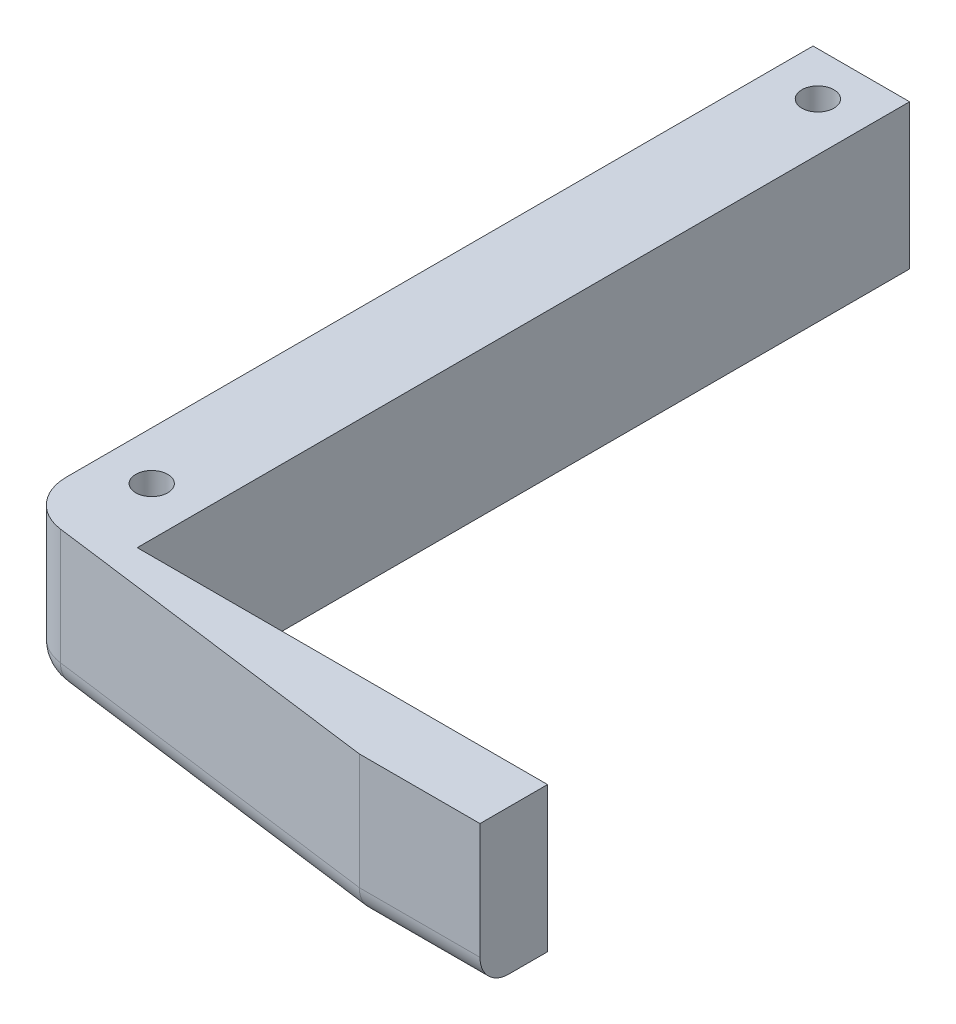
ISO-10303-21;
HEADER;
FILE_DESCRIPTION(('STEP AP214'),'2;1');
FILE_NAME('part.step','',(''),(''),'','','');
FILE_SCHEMA(('AUTOMOTIVE_DESIGN { 1 0 10303 214 1 1 1 1 }'));
ENDSEC;
DATA;
#1=APPLICATION_CONTEXT('core data for automotive mechanical design processes');
#2=APPLICATION_PROTOCOL_DEFINITION('international standard','automotive_design',2000,#1);
#3=PRODUCT_CONTEXT('',#1,'mechanical');
#4=PRODUCT('Part','Part','',(#3));
#5=PRODUCT_RELATED_PRODUCT_CATEGORY('part','',(#4));
#6=PRODUCT_DEFINITION_FORMATION('','',#4);
#7=PRODUCT_DEFINITION_CONTEXT('part definition',#1,'design');
#8=PRODUCT_DEFINITION('design','',#6,#7);
#9=PRODUCT_DEFINITION_SHAPE('','',#8);
#10=(LENGTH_UNIT() NAMED_UNIT(*) SI_UNIT(.MILLI.,.METRE.));
#11=(NAMED_UNIT(*) PLANE_ANGLE_UNIT() SI_UNIT($,.RADIAN.));
#12=(NAMED_UNIT(*) SI_UNIT($,.STERADIAN.) SOLID_ANGLE_UNIT());
#13=UNCERTAINTY_MEASURE_WITH_UNIT(LENGTH_MEASURE(1.E-05),#10,'distance_accuracy_value','');
#14=(GEOMETRIC_REPRESENTATION_CONTEXT(3) GLOBAL_UNCERTAINTY_ASSIGNED_CONTEXT((#13)) GLOBAL_UNIT_ASSIGNED_CONTEXT((#10,
#11,#12)) REPRESENTATION_CONTEXT('',''));
#15=CARTESIAN_POINT('',(0.,0.,0.));
#16=DIRECTION('',(0.,0.,1.));
#17=DIRECTION('',(1.,0.,0.));
#18=AXIS2_PLACEMENT_3D('',#15,#16,#17);
#19=CARTESIAN_POINT('',(0.,15.,0.));
#20=DIRECTION('',(0.,1.,0.));
#21=DIRECTION('',(0.,0.,-1.));
#22=AXIS2_PLACEMENT_3D('',#19,#20,#21);
#23=PLANE('',#22);
#24=CARTESIAN_POINT('',(-35.2774040599402,15.,-24.4533066809845));
#25=DIRECTION('',(0.,-1.,0.));
#26=DIRECTION('',(0.,0.,-1.));
#27=AXIS2_PLACEMENT_3D('',#24,#25,#26);
#28=CIRCLE('',#27,1.66);
#29=CARTESIAN_POINT('',(-35.2774040599402,15.,-26.1133066809845));
#30=VERTEX_POINT('',#29);
#31=EDGE_CURVE('E162',#30,#30,#28,.T.);
#32=ORIENTED_EDGE('',*,*,#31,.T.);
#33=EDGE_LOOP('',(#32));
#34=FACE_BOUND('',#33,.T.);
#35=DIRECTION('',(0.991444861373811,0.,0.130526192220048));
#36=VECTOR('',#35,1.);
#37=CARTESIAN_POINT('',(-7.51652102515629,15.,57.0936454902174));
#38=LINE('',#37,#36);
#39=CARTESIAN_POINT('',(-0.277404059939151,15.,58.0466933190155));
#40=VERTEX_POINT('',#39);
#41=CARTESIAN_POINT('',(-35.9300350210405,15.,53.3529354074249));
#42=VERTEX_POINT('',#41);
#43=EDGE_CURVE('E179',#40,#42,#38,.F.);
#44=ORIENTED_EDGE('',*,*,#43,.F.);
#45=DIRECTION('',(-1.,0.,0.));
#46=VECTOR('',#45,1.);
#47=CARTESIAN_POINT('',(12.2225959400598,15.,58.0466933190155));
#48=LINE('',#47,#46);
#49=CARTESIAN_POINT('',(12.2225959400598,15.,58.0466933190155));
#50=VERTEX_POINT('',#49);
#51=EDGE_CURVE('E140',#50,#40,#48,.T.);
#52=ORIENTED_EDGE('',*,*,#51,.F.);
#53=DIRECTION('',(0.,0.,1.));
#54=VECTOR('',#53,1.);
#55=CARTESIAN_POINT('',(12.2225959400597,15.,51.0466933190155));
#56=LINE('',#55,#54);
#57=CARTESIAN_POINT('',(12.2225959400597,15.,51.0466933190155));
#58=VERTEX_POINT('',#57);
#59=EDGE_CURVE('E154',#58,#50,#56,.T.);
#60=ORIENTED_EDGE('',*,*,#59,.F.);
#61=DIRECTION('',(1.,0.,0.));
#62=VECTOR('',#61,1.);
#63=CARTESIAN_POINT('',(-30.2774040599402,15.,51.0466933190155));
#64=LINE('',#63,#62);
#65=CARTESIAN_POINT('',(-30.2774040599402,15.,51.0466933190155));
#66=VERTEX_POINT('',#65);
#67=EDGE_CURVE('E148',#66,#58,#64,.T.);
#68=ORIENTED_EDGE('',*,*,#67,.F.);
#69=DIRECTION('',(0.,0.,1.));
#70=VECTOR('',#69,1.);
#71=CARTESIAN_POINT('',(-30.2774040599402,15.,-28.9533066809845));
#72=LINE('',#71,#70);
#73=CARTESIAN_POINT('',(-30.2774040599402,15.,-28.9533066809845));
#74=VERTEX_POINT('',#73);
#75=EDGE_CURVE('E146',#74,#66,#72,.T.);
#76=ORIENTED_EDGE('',*,*,#75,.F.);
#77=DIRECTION('',(1.,0.,0.));
#78=VECTOR('',#77,1.);
#79=CARTESIAN_POINT('',(-40.2774040599402,15.,-28.9533066809845));
#80=LINE('',#79,#78);
#81=CARTESIAN_POINT('',(-40.2774040599402,15.,-28.9533066809845));
#82=VERTEX_POINT('',#81);
#83=EDGE_CURVE('E122',#82,#74,#80,.T.);
#84=ORIENTED_EDGE('',*,*,#83,.F.);
#85=DIRECTION('',(0.,0.,-1.));
#86=VECTOR('',#85,1.);
#87=CARTESIAN_POINT('',(-40.2774040599402,15.,58.0466933190154));
#88=LINE('',#87,#86);
#89=CARTESIAN_POINT('',(-40.2774040599402,15.,48.3957111005558));
#90=VERTEX_POINT('',#89);
#91=EDGE_CURVE('E133',#90,#82,#88,.T.);
#92=ORIENTED_EDGE('',*,*,#91,.F.);
#93=CARTESIAN_POINT('',(-35.2774040599402,15.,48.3957111005558));
#94=DIRECTION('',(0.,-1.,0.));
#95=DIRECTION('',(0.,0.,-1.));
#96=AXIS2_PLACEMENT_3D('',#93,#94,#95);
#97=CIRCLE('',#96,5.);
#98=EDGE_CURVE('E185',#42,#90,#97,.T.);
#99=ORIENTED_EDGE('',*,*,#98,.F.);
#100=EDGE_LOOP('',(#44,#52,#60,#68,#76,#84,#92,#99));
#101=FACE_BOUND('',#100,.T.);
#102=CARTESIAN_POINT('',(-35.2774040599403,15.,44.5466933190155));
#103=DIRECTION('',(0.,-1.,0.));
#104=DIRECTION('',(0.,0.,-1.));
#105=AXIS2_PLACEMENT_3D('',#102,#103,#104);
#106=CIRCLE('',#105,1.66);
#107=CARTESIAN_POINT('',(-35.2774040599403,15.,42.8866933190155));
#108=VERTEX_POINT('',#107);
#109=EDGE_CURVE('E211',#108,#108,#106,.T.);
#110=ORIENTED_EDGE('',*,*,#109,.T.);
#111=EDGE_LOOP('',(#110));
#112=FACE_BOUND('',#111,.T.);
#113=ADVANCED_FACE('F37',(#34,#101,#112),#23,.T.);
#114=CARTESIAN_POINT('',(0.,0.,0.));
#115=DIRECTION('',(0.,1.,0.));
#116=DIRECTION('',(0.,0.,-1.));
#117=AXIS2_PLACEMENT_3D('',#114,#115,#116);
#118=PLANE('',#117);
#119=DIRECTION('',(1.,0.,0.));
#120=VECTOR('',#119,1.);
#121=CARTESIAN_POINT('',(-40.2774040599402,0.,-28.9533066809845));
#122=LINE('',#121,#120);
#123=CARTESIAN_POINT('',(-37.2774040599402,0.,-28.9533066809845));
#124=VERTEX_POINT('',#123);
#125=CARTESIAN_POINT('',(-30.2774040599402,0.,-28.9533066809845));
#126=VERTEX_POINT('',#125);
#127=EDGE_CURVE('E158',#124,#126,#122,.T.);
#128=ORIENTED_EDGE('',*,*,#127,.T.);
#129=DIRECTION('',(0.,0.,1.));
#130=VECTOR('',#129,1.);
#131=CARTESIAN_POINT('',(-30.2774040599402,0.,-28.9533066809845));
#132=LINE('',#131,#130);
#133=CARTESIAN_POINT('',(-30.2774040599402,0.,51.0466933190155));
#134=VERTEX_POINT('',#133);
#135=EDGE_CURVE('E161',#126,#134,#132,.T.);
#136=ORIENTED_EDGE('',*,*,#135,.T.);
#137=DIRECTION('',(1.,0.,0.));
#138=VECTOR('',#137,1.);
#139=CARTESIAN_POINT('',(-30.2774040599402,0.,51.0466933190155));
#140=LINE('',#139,#138);
#141=CARTESIAN_POINT('',(12.2225959400597,0.,51.0466933190155));
#142=VERTEX_POINT('',#141);
#143=EDGE_CURVE('E165',#134,#142,#140,.T.);
#144=ORIENTED_EDGE('',*,*,#143,.T.);
#145=DIRECTION('',(0.,0.,1.));
#146=VECTOR('',#145,1.);
#147=CARTESIAN_POINT('',(12.2225959400597,0.,51.0466933190155));
#148=LINE('',#147,#146);
#149=CARTESIAN_POINT('',(12.2225959400597,0.,55.0466933190155));
#150=VERTEX_POINT('',#149);
#151=EDGE_CURVE('E168',#142,#150,#148,.T.);
#152=ORIENTED_EDGE('',*,*,#151,.T.);
#153=DIRECTION('',(-1.,0.,0.));
#154=VECTOR('',#153,1.);
#155=CARTESIAN_POINT('',(0.,0.,55.0466933190155));
#156=LINE('',#155,#154);
#157=CARTESIAN_POINT('',(-0.0807736714934411,0.,55.0466933190155));
#158=VERTEX_POINT('',#157);
#159=EDGE_CURVE('E187',#158,#150,#156,.F.);
#160=ORIENTED_EDGE('',*,*,#159,.F.);
#161=DIRECTION('',(-0.991444861373811,0.,-0.130526192220048));
#162=VECTOR('',#161,1.);
#163=CARTESIAN_POINT('',(0.114174516720995,0.,55.072358734894));
#164=LINE('',#163,#162);
#165=CARTESIAN_POINT('',(-35.5384564443803,0.,50.3786008233034));
#166=VERTEX_POINT('',#165);
#167=EDGE_CURVE('E189',#166,#158,#164,.F.);
#168=ORIENTED_EDGE('',*,*,#167,.F.);
#169=CARTESIAN_POINT('',(-35.2774040599402,0.,48.3957111005558));
#170=DIRECTION('',(0.,-1.,0.));
#171=DIRECTION('',(0.,0.,-1.));
#172=AXIS2_PLACEMENT_3D('',#169,#170,#171);
#173=CIRCLE('',#172,2.);
#174=CARTESIAN_POINT('',(-37.2774040599402,0.,48.3957111005558));
#175=VERTEX_POINT('',#174);
#176=EDGE_CURVE('E191',#175,#166,#173,.F.);
#177=ORIENTED_EDGE('',*,*,#176,.F.);
#178=DIRECTION('',(0.,0.,-1.));
#179=VECTOR('',#178,1.);
#180=CARTESIAN_POINT('',(-37.2774040599402,0.,0.));
#181=LINE('',#180,#179);
#182=EDGE_CURVE('E194',#124,#175,#181,.F.);
#183=ORIENTED_EDGE('',*,*,#182,.F.);
#184=EDGE_LOOP('',(#128,#136,#144,#152,#160,#168,#177,#183));
#185=FACE_BOUND('',#184,.T.);
#186=CARTESIAN_POINT('',(-35.2774040599402,0.,-24.4533066809845));
#187=DIRECTION('',(0.,-1.,0.));
#188=DIRECTION('',(0.,0.,-1.));
#189=AXIS2_PLACEMENT_3D('',#186,#187,#188);
#190=CIRCLE('',#189,1.66);
#191=CARTESIAN_POINT('',(-35.2774040599402,0.,-26.1133066809845));
#192=VERTEX_POINT('',#191);
#193=EDGE_CURVE('E216',#192,#192,#190,.T.);
#194=ORIENTED_EDGE('',*,*,#193,.F.);
#195=EDGE_LOOP('',(#194));
#196=FACE_BOUND('',#195,.T.);
#197=CARTESIAN_POINT('',(-35.2774040599403,0.,44.5466933190155));
#198=DIRECTION('',(0.,-1.,0.));
#199=DIRECTION('',(0.,0.,-1.));
#200=AXIS2_PLACEMENT_3D('',#197,#198,#199);
#201=CIRCLE('',#200,1.66);
#202=CARTESIAN_POINT('',(-35.2774040599403,0.,42.8866933190155));
#203=VERTEX_POINT('',#202);
#204=EDGE_CURVE('E209',#203,#203,#201,.T.);
#205=ORIENTED_EDGE('',*,*,#204,.F.);
#206=EDGE_LOOP('',(#205));
#207=FACE_BOUND('',#206,.T.);
#208=ADVANCED_FACE('F242',(#185,#196,#207),#118,.F.);
#209=CARTESIAN_POINT('',(12.2225959400598,15.,58.0466933190155));
#210=DIRECTION('',(0.,0.,-1.));
#211=DIRECTION('',(1.,0.,0.));
#212=AXIS2_PLACEMENT_3D('',#209,#210,#211);
#213=PLANE('',#212);
#214=DIRECTION('',(0.,-1.,0.));
#215=VECTOR('',#214,1.);
#216=CARTESIAN_POINT('',(12.2225959400598,15.,58.0466933190155));
#217=LINE('',#216,#215);
#218=CARTESIAN_POINT('',(12.2225959400598,3.,58.0466933190155));
#219=VERTEX_POINT('',#218);
#220=EDGE_CURVE('E157',#50,#219,#217,.T.);
#221=ORIENTED_EDGE('',*,*,#220,.F.);
#222=ORIENTED_EDGE('',*,*,#51,.T.);
#223=DIRECTION('',(0.,1.,0.));
#224=VECTOR('',#223,1.);
#225=CARTESIAN_POINT('',(-0.277404059939151,15.,58.0466933190155));
#226=LINE('',#225,#224);
#227=CARTESIAN_POINT('',(-0.277404059939151,3.,58.0466933190155));
#228=VERTEX_POINT('',#227);
#229=EDGE_CURVE('E129',#228,#40,#226,.T.);
#230=ORIENTED_EDGE('',*,*,#229,.F.);
#231=DIRECTION('',(-1.,0.,0.));
#232=VECTOR('',#231,1.);
#233=CARTESIAN_POINT('',(12.2225959400598,3.,58.0466933190155));
#234=LINE('',#233,#232);
#235=EDGE_CURVE('E46',#219,#228,#234,.T.);
#236=ORIENTED_EDGE('',*,*,#235,.F.);
#237=EDGE_LOOP('',(#221,#222,#230,#236));
#238=FACE_BOUND('',#237,.T.);
#239=ADVANCED_FACE('F226',(#238),#213,.F.);
#240=CARTESIAN_POINT('',(-40.2774040599402,15.,58.0466933190154));
#241=DIRECTION('',(1.,0.,0.));
#242=DIRECTION('',(0.,0.,1.));
#243=AXIS2_PLACEMENT_3D('',#240,#241,#242);
#244=PLANE('',#243);
#245=DIRECTION('',(0.,1.,0.));
#246=VECTOR('',#245,1.);
#247=CARTESIAN_POINT('',(-40.2774040599402,0.,48.3957111005558));
#248=LINE('',#247,#246);
#249=CARTESIAN_POINT('',(-40.2774040599402,3.,48.3957111005558));
#250=VERTEX_POINT('',#249);
#251=EDGE_CURVE('E136',#90,#250,#248,.F.);
#252=ORIENTED_EDGE('',*,*,#251,.F.);
#253=ORIENTED_EDGE('',*,*,#91,.T.);
#254=DIRECTION('',(0.,-1.,0.));
#255=VECTOR('',#254,1.);
#256=CARTESIAN_POINT('',(-40.2774040599402,15.,-28.9533066809845));
#257=LINE('',#256,#255);
#258=CARTESIAN_POINT('',(-40.2774040599402,3.,-28.9533066809845));
#259=VERTEX_POINT('',#258);
#260=EDGE_CURVE('E118',#82,#259,#257,.T.);
#261=ORIENTED_EDGE('',*,*,#260,.T.);
#262=DIRECTION('',(0.,0.,-1.));
#263=VECTOR('',#262,1.);
#264=CARTESIAN_POINT('',(-40.2774040599402,3.,58.0466933190154));
#265=LINE('',#264,#263);
#266=EDGE_CURVE('E200',#250,#259,#265,.T.);
#267=ORIENTED_EDGE('',*,*,#266,.F.);
#268=EDGE_LOOP('',(#252,#253,#261,#267));
#269=FACE_BOUND('',#268,.T.);
#270=ADVANCED_FACE('F134',(#269),#244,.F.);
#271=CARTESIAN_POINT('',(-40.2774040599402,15.,-28.9533066809845));
#272=DIRECTION('',(0.,0.,1.));
#273=DIRECTION('',(-1.,0.,0.));
#274=AXIS2_PLACEMENT_3D('',#271,#272,#273);
#275=PLANE('',#274);
#276=ORIENTED_EDGE('',*,*,#260,.F.);
#277=ORIENTED_EDGE('',*,*,#83,.T.);
#278=DIRECTION('',(0.,-1.,0.));
#279=VECTOR('',#278,1.);
#280=CARTESIAN_POINT('',(-30.2774040599402,15.,-28.9533066809845));
#281=LINE('',#280,#279);
#282=EDGE_CURVE('E130',#74,#126,#281,.T.);
#283=ORIENTED_EDGE('',*,*,#282,.T.);
#284=ORIENTED_EDGE('',*,*,#127,.F.);
#285=CARTESIAN_POINT('',(-37.2774040599402,3.,-28.9533066809845));
#286=DIRECTION('',(0.,0.,-1.));
#287=DIRECTION('',(-1.,0.,0.));
#288=AXIS2_PLACEMENT_3D('',#285,#286,#287);
#289=CIRCLE('',#288,3.);
#290=EDGE_CURVE('E125',#259,#124,#289,.F.);
#291=ORIENTED_EDGE('',*,*,#290,.F.);
#292=EDGE_LOOP('',(#276,#277,#283,#284,#291));
#293=FACE_BOUND('',#292,.T.);
#294=ADVANCED_FACE('F120',(#293),#275,.F.);
#295=CARTESIAN_POINT('',(-30.2774040599402,15.,-28.9533066809845));
#296=DIRECTION('',(-1.,0.,0.));
#297=DIRECTION('',(0.,0.,-1.));
#298=AXIS2_PLACEMENT_3D('',#295,#296,#297);
#299=PLANE('',#298);
#300=ORIENTED_EDGE('',*,*,#135,.F.);
#301=ORIENTED_EDGE('',*,*,#282,.F.);
#302=ORIENTED_EDGE('',*,*,#75,.T.);
#303=DIRECTION('',(0.,-1.,0.));
#304=VECTOR('',#303,1.);
#305=CARTESIAN_POINT('',(-30.2774040599402,15.,51.0466933190155));
#306=LINE('',#305,#304);
#307=EDGE_CURVE('E175',#66,#134,#306,.T.);
#308=ORIENTED_EDGE('',*,*,#307,.T.);
#309=EDGE_LOOP('',(#300,#301,#302,#308));
#310=FACE_BOUND('',#309,.T.);
#311=ADVANCED_FACE('F239',(#310),#299,.F.);
#312=CARTESIAN_POINT('',(-30.2774040599402,15.,51.0466933190155));
#313=DIRECTION('',(0.,0.,1.));
#314=DIRECTION('',(-1.,0.,0.));
#315=AXIS2_PLACEMENT_3D('',#312,#313,#314);
#316=PLANE('',#315);
#317=ORIENTED_EDGE('',*,*,#143,.F.);
#318=ORIENTED_EDGE('',*,*,#307,.F.);
#319=ORIENTED_EDGE('',*,*,#67,.T.);
#320=DIRECTION('',(0.,-1.,0.));
#321=VECTOR('',#320,1.);
#322=CARTESIAN_POINT('',(12.2225959400597,15.,51.0466933190155));
#323=LINE('',#322,#321);
#324=EDGE_CURVE('E173',#58,#142,#323,.T.);
#325=ORIENTED_EDGE('',*,*,#324,.T.);
#326=EDGE_LOOP('',(#317,#318,#319,#325));
#327=FACE_BOUND('',#326,.T.);
#328=ADVANCED_FACE('F236',(#327),#316,.F.);
#329=CARTESIAN_POINT('',(12.2225959400597,15.,51.0466933190155));
#330=DIRECTION('',(-1.,0.,0.));
#331=DIRECTION('',(0.,0.,-1.));
#332=AXIS2_PLACEMENT_3D('',#329,#330,#331);
#333=PLANE('',#332);
#334=ORIENTED_EDGE('',*,*,#151,.F.);
#335=ORIENTED_EDGE('',*,*,#324,.F.);
#336=ORIENTED_EDGE('',*,*,#59,.T.);
#337=ORIENTED_EDGE('',*,*,#220,.T.);
#338=CARTESIAN_POINT('',(12.2225959400597,3.,55.0466933190155));
#339=DIRECTION('',(1.,0.,0.));
#340=DIRECTION('',(0.,0.,-1.));
#341=AXIS2_PLACEMENT_3D('',#338,#339,#340);
#342=CIRCLE('',#341,3.);
#343=EDGE_CURVE('E11',#150,#219,#342,.F.);
#344=ORIENTED_EDGE('',*,*,#343,.F.);
#345=EDGE_LOOP('',(#334,#335,#336,#337,#344));
#346=FACE_BOUND('',#345,.T.);
#347=ADVANCED_FACE('F233',(#346),#333,.F.);
#348=CARTESIAN_POINT('',(-35.2774040599402,15.,-24.4533066809845));
#349=DIRECTION('',(0.,-1.,0.));
#350=DIRECTION('',(0.,0.,1.));
#351=AXIS2_PLACEMENT_3D('',#348,#349,#350);
#352=CYLINDRICAL_SURFACE('',#351,1.66);
#353=ORIENTED_EDGE('',*,*,#31,.F.);
#354=EDGE_LOOP('',(#353));
#355=FACE_BOUND('',#354,.T.);
#356=ORIENTED_EDGE('',*,*,#193,.T.);
#357=EDGE_LOOP('',(#356));
#358=FACE_BOUND('',#357,.T.);
#359=ADVANCED_FACE('F269',(#355,#358),#352,.F.);
#360=CARTESIAN_POINT('',(-35.2774040599403,15.,44.5466933190155));
#361=DIRECTION('',(0.,-1.,0.));
#362=DIRECTION('',(0.,0.,1.));
#363=AXIS2_PLACEMENT_3D('',#360,#361,#362);
#364=CYLINDRICAL_SURFACE('',#363,1.66);
#365=ORIENTED_EDGE('',*,*,#109,.F.);
#366=EDGE_LOOP('',(#365));
#367=FACE_BOUND('',#366,.T.);
#368=ORIENTED_EDGE('',*,*,#204,.T.);
#369=EDGE_LOOP('',(#368));
#370=FACE_BOUND('',#369,.T.);
#371=ADVANCED_FACE('F286',(#367,#370),#364,.F.);
#372=CARTESIAN_POINT('',(-40.2774040599402,15.,52.7805934155196));
#373=DIRECTION('',(0.130526192220048,0.,-0.991444861373811));
#374=DIRECTION('',(0.,-1.,0.));
#375=AXIS2_PLACEMENT_3D('',#372,#373,#374);
#376=PLANE('',#375);
#377=ORIENTED_EDGE('',*,*,#229,.T.);
#378=ORIENTED_EDGE('',*,*,#43,.T.);
#379=DIRECTION('',(0.,-1.,0.));
#380=VECTOR('',#379,1.);
#381=CARTESIAN_POINT('',(-35.9300350210405,15.,53.3529354074249));
#382=LINE('',#381,#380);
#383=CARTESIAN_POINT('',(-35.9300350210405,3.,53.3529354074249));
#384=VERTEX_POINT('',#383);
#385=EDGE_CURVE('E183',#384,#42,#382,.F.);
#386=ORIENTED_EDGE('',*,*,#385,.F.);
#387=DIRECTION('',(0.991444861373811,0.,0.130526192220048));
#388=VECTOR('',#387,1.);
#389=CARTESIAN_POINT('',(-35.9300350210405,3.,53.3529354074249));
#390=LINE('',#389,#388);
#391=EDGE_CURVE('E203',#228,#384,#390,.F.);
#392=ORIENTED_EDGE('',*,*,#391,.F.);
#393=EDGE_LOOP('',(#377,#378,#386,#392));
#394=FACE_BOUND('',#393,.T.);
#395=ADVANCED_FACE('F230',(#394),#376,.F.);
#396=CARTESIAN_POINT('',(-35.2774040599402,15.,48.3957111005558));
#397=DIRECTION('',(0.,-1.,0.));
#398=DIRECTION('',(0.,0.,1.));
#399=AXIS2_PLACEMENT_3D('',#396,#397,#398);
#400=CYLINDRICAL_SURFACE('',#399,5.);
#401=ORIENTED_EDGE('',*,*,#385,.T.);
#402=ORIENTED_EDGE('',*,*,#98,.T.);
#403=ORIENTED_EDGE('',*,*,#251,.T.);
#404=CARTESIAN_POINT('',(-35.2774040599402,3.,48.3957111005558));
#405=DIRECTION('',(0.,-1.,0.));
#406=DIRECTION('',(0.,0.,-1.));
#407=AXIS2_PLACEMENT_3D('',#404,#405,#406);
#408=CIRCLE('',#407,5.);
#409=EDGE_CURVE('E197',#384,#250,#408,.T.);
#410=ORIENTED_EDGE('',*,*,#409,.F.);
#411=EDGE_LOOP('',(#401,#402,#403,#410));
#412=FACE_BOUND('',#411,.T.);
#413=ADVANCED_FACE('F249',(#412),#400,.T.);
#414=CARTESIAN_POINT('',(12.2225959400598,3.,55.0466933190155));
#415=DIRECTION('',(-1.,0.,0.));
#416=DIRECTION('',(0.,0.,-1.));
#417=AXIS2_PLACEMENT_3D('',#414,#415,#416);
#418=CYLINDRICAL_SURFACE('',#417,3.);
#419=ORIENTED_EDGE('',*,*,#343,.T.);
#420=ORIENTED_EDGE('',*,*,#235,.T.);
#421=CARTESIAN_POINT('',(-0.0807736714934846,3.,55.0466933190154));
#422=DIRECTION('',(0.997858923238603,0.,0.0654031292301415));
#423=DIRECTION('',(-0.0654031292301415,0.,0.997858923238604));
#424=AXIS2_PLACEMENT_3D('',#421,#422,#423);
#425=ELLIPSE('',#424,3.0064370124219,3.);
#426=EDGE_CURVE('E41',#228,#158,#425,.T.);
#427=ORIENTED_EDGE('',*,*,#426,.T.);
#428=ORIENTED_EDGE('',*,*,#159,.T.);
#429=EDGE_LOOP('',(#419,#420,#427,#428));
#430=FACE_BOUND('',#429,.T.);
#431=ADVANCED_FACE('F39',(#430),#418,.T.);
#432=CARTESIAN_POINT('',(-37.2774040599402,3.,58.0466933190154));
#433=DIRECTION('',(0.,0.,-1.));
#434=DIRECTION('',(1.,0.,0.));
#435=AXIS2_PLACEMENT_3D('',#432,#433,#434);
#436=CYLINDRICAL_SURFACE('',#435,3.);
#437=ORIENTED_EDGE('',*,*,#290,.T.);
#438=ORIENTED_EDGE('',*,*,#182,.T.);
#439=CARTESIAN_POINT('',(-37.2774040599402,3.,48.3957111005558));
#440=DIRECTION('',(0.,0.,-1.));
#441=DIRECTION('',(-1.,0.,0.));
#442=AXIS2_PLACEMENT_3D('',#439,#440,#441);
#443=CIRCLE('',#442,3.);
#444=EDGE_CURVE('E207',#175,#250,#443,.T.);
#445=ORIENTED_EDGE('',*,*,#444,.T.);
#446=ORIENTED_EDGE('',*,*,#266,.T.);
#447=EDGE_LOOP('',(#437,#438,#445,#446));
#448=FACE_BOUND('',#447,.T.);
#449=ADVANCED_FACE('F246',(#448),#436,.T.);
#450=CARTESIAN_POINT('',(-7.12494244849614,3.,54.1193109060959));
#451=DIRECTION('',(0.991444861373811,0.,0.130526192220048));
#452=DIRECTION('',(-0.130526192220048,0.,0.991444861373811));
#453=AXIS2_PLACEMENT_3D('',#450,#451,#452);
#454=CYLINDRICAL_SURFACE('',#453,3.);
#455=ORIENTED_EDGE('',*,*,#426,.F.);
#456=ORIENTED_EDGE('',*,*,#391,.T.);
#457=CARTESIAN_POINT('',(-35.5384564443803,3.,50.3786008233034));
#458=DIRECTION('',(0.991444861373811,0.,0.130526192220049));
#459=DIRECTION('',(0.130526192220049,0.,-0.991444861373811));
#460=AXIS2_PLACEMENT_3D('',#457,#458,#459);
#461=CIRCLE('',#460,3.);
#462=EDGE_CURVE('E206',#384,#166,#461,.T.);
#463=ORIENTED_EDGE('',*,*,#462,.T.);
#464=ORIENTED_EDGE('',*,*,#167,.T.);
#465=EDGE_LOOP('',(#455,#456,#463,#464));
#466=FACE_BOUND('',#465,.T.);
#467=ADVANCED_FACE('F252',(#466),#454,.T.);
#468=CARTESIAN_POINT('',(-35.2774040599402,3.,48.3957111005558));
#469=DIRECTION('',(0.,1.,0.));
#470=DIRECTION('',(0.,0.,-1.));
#471=AXIS2_PLACEMENT_3D('',#468,#469,#470);
#472=DEGENERATE_TOROIDAL_SURFACE('',#471,2.,3.,.T.);
#473=ORIENTED_EDGE('',*,*,#444,.F.);
#474=ORIENTED_EDGE('',*,*,#176,.T.);
#475=ORIENTED_EDGE('',*,*,#462,.F.);
#476=ORIENTED_EDGE('',*,*,#409,.T.);
#477=EDGE_LOOP('',(#473,#474,#475,#476));
#478=FACE_BOUND('',#477,.T.);
#479=ADVANCED_FACE('F251',(#478),#472,.T.);
#480=CLOSED_SHELL('',(#113,#208,#239,#270,#294,#311,#328,#347,#359,#371,#395,#413,#431,#449,
#467,#479));
#481=MANIFOLD_SOLID_BREP('B2',#480);
#482=ADVANCED_BREP_SHAPE_REPRESENTATION('',(#18,#481),#14);
#483=SHAPE_DEFINITION_REPRESENTATION(#9,#482);
ENDSEC;
END-ISO-10303-21;
